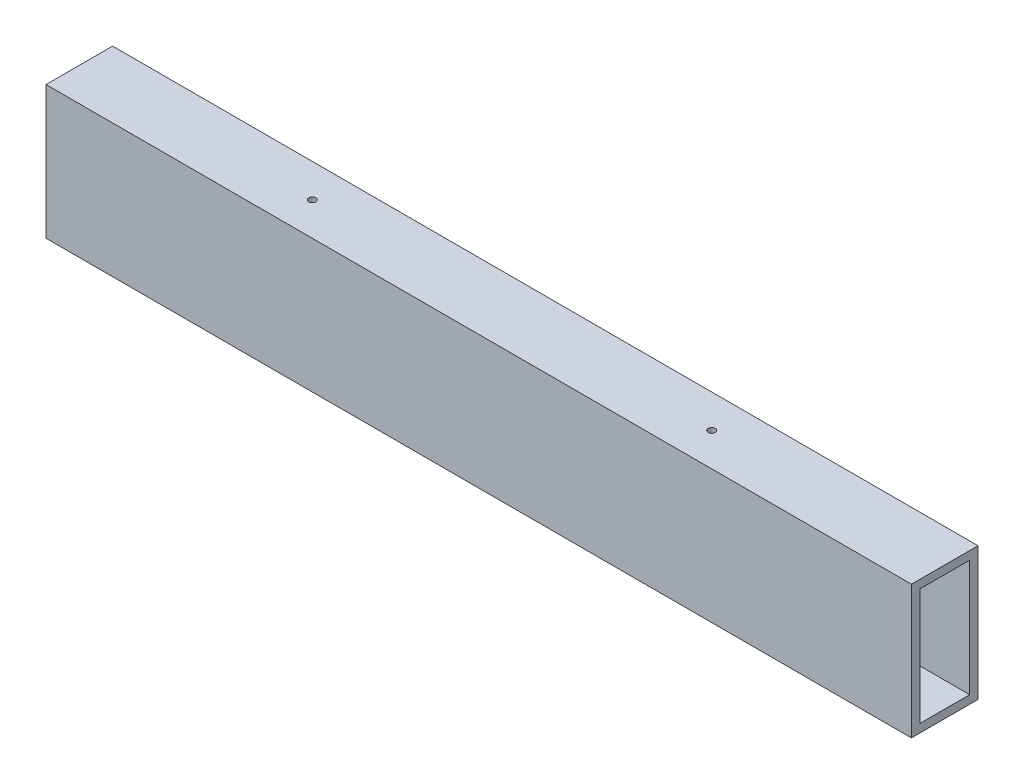
ISO-10303-21;
HEADER;
FILE_DESCRIPTION(('STEP AP214'),'2;1');
FILE_NAME('part.step','',(''),(''),'','','');
FILE_SCHEMA(('AUTOMOTIVE_DESIGN { 1 0 10303 214 1 1 1 1 }'));
ENDSEC;
DATA;
#1=APPLICATION_CONTEXT('core data for automotive mechanical design processes');
#2=APPLICATION_PROTOCOL_DEFINITION('international standard','automotive_design',2000,#1);
#3=PRODUCT_CONTEXT('',#1,'mechanical');
#4=PRODUCT('Part','Part','',(#3));
#5=PRODUCT_RELATED_PRODUCT_CATEGORY('part','',(#4));
#6=PRODUCT_DEFINITION_FORMATION('','',#4);
#7=PRODUCT_DEFINITION_CONTEXT('part definition',#1,'design');
#8=PRODUCT_DEFINITION('design','',#6,#7);
#9=PRODUCT_DEFINITION_SHAPE('','',#8);
#10=(LENGTH_UNIT() NAMED_UNIT(*) SI_UNIT(.MILLI.,.METRE.));
#11=(NAMED_UNIT(*) PLANE_ANGLE_UNIT() SI_UNIT($,.RADIAN.));
#12=(NAMED_UNIT(*) SI_UNIT($,.STERADIAN.) SOLID_ANGLE_UNIT());
#13=UNCERTAINTY_MEASURE_WITH_UNIT(LENGTH_MEASURE(1.E-05),#10,'distance_accuracy_value','');
#14=(GEOMETRIC_REPRESENTATION_CONTEXT(3) GLOBAL_UNCERTAINTY_ASSIGNED_CONTEXT((#13)) GLOBAL_UNIT_ASSIGNED_CONTEXT((#10,
#11,#12)) REPRESENTATION_CONTEXT('',''));
#15=CARTESIAN_POINT('',(0.,0.,0.));
#16=DIRECTION('',(0.,0.,1.));
#17=DIRECTION('',(1.,0.,0.));
#18=AXIS2_PLACEMENT_3D('',#15,#16,#17);
#19=CARTESIAN_POINT('',(330.2,-25.4,12.7));
#20=DIRECTION('',(0.,1.,0.));
#21=DIRECTION('',(0.,0.,1.));
#22=AXIS2_PLACEMENT_3D('',#19,#20,#21);
#23=PLANE('',#22);
#24=CARTESIAN_POINT('',(241.3,-25.4,0.));
#25=DIRECTION('',(0.,-1.,0.));
#26=DIRECTION('',(0.,0.,-1.));
#27=AXIS2_PLACEMENT_3D('',#24,#25,#26);
#28=CIRCLE('',#27,1.35254999999998);
#29=CARTESIAN_POINT('',(241.3,-25.4,-1.35254999999998));
#30=VERTEX_POINT('',#29);
#31=EDGE_CURVE('E172',#30,#30,#28,.T.);
#32=ORIENTED_EDGE('',*,*,#31,.F.);
#33=EDGE_LOOP('',(#32));
#34=FACE_BOUND('',#33,.T.);
#35=DIRECTION('',(0.,0.,-1.));
#36=VECTOR('',#35,1.);
#37=CARTESIAN_POINT('',(0.,-25.4,12.7));
#38=LINE('',#37,#36);
#39=CARTESIAN_POINT('',(0.,-25.4,12.7));
#40=VERTEX_POINT('',#39);
#41=CARTESIAN_POINT('',(0.,-25.4,-12.7));
#42=VERTEX_POINT('',#41);
#43=EDGE_CURVE('E145',#40,#42,#38,.T.);
#44=ORIENTED_EDGE('',*,*,#43,.T.);
#45=DIRECTION('',(-1.,0.,0.));
#46=VECTOR('',#45,1.);
#47=CARTESIAN_POINT('',(330.2,-25.4,-12.7));
#48=LINE('',#47,#46);
#49=CARTESIAN_POINT('',(330.2,-25.4,-12.7));
#50=VERTEX_POINT('',#49);
#51=EDGE_CURVE('E151',#50,#42,#48,.T.);
#52=ORIENTED_EDGE('',*,*,#51,.F.);
#53=DIRECTION('',(0.,0.,-1.));
#54=VECTOR('',#53,1.);
#55=CARTESIAN_POINT('',(330.2,-25.4,12.7));
#56=LINE('',#55,#54);
#57=CARTESIAN_POINT('',(330.2,-25.4,12.7));
#58=VERTEX_POINT('',#57);
#59=EDGE_CURVE('E149',#58,#50,#56,.T.);
#60=ORIENTED_EDGE('',*,*,#59,.F.);
#61=DIRECTION('',(-1.,0.,0.));
#62=VECTOR('',#61,1.);
#63=CARTESIAN_POINT('',(330.2,-25.4,12.7));
#64=LINE('',#63,#62);
#65=EDGE_CURVE('E161',#58,#40,#64,.T.);
#66=ORIENTED_EDGE('',*,*,#65,.T.);
#67=EDGE_LOOP('',(#44,#52,#60,#66));
#68=FACE_BOUND('',#67,.T.);
#69=CARTESIAN_POINT('',(88.9,-25.4,0.));
#70=DIRECTION('',(0.,-1.,0.));
#71=DIRECTION('',(0.,0.,-1.));
#72=AXIS2_PLACEMENT_3D('',#69,#70,#71);
#73=CIRCLE('',#72,1.35254999999999);
#74=CARTESIAN_POINT('',(88.9,-25.4,-1.35254999999999));
#75=VERTEX_POINT('',#74);
#76=EDGE_CURVE('E185',#75,#75,#73,.T.);
#77=ORIENTED_EDGE('',*,*,#76,.F.);
#78=EDGE_LOOP('',(#77));
#79=FACE_BOUND('',#78,.T.);
#80=ADVANCED_FACE('F35',(#34,#68,#79),#23,.F.);
#81=CARTESIAN_POINT('',(330.2,0.,0.));
#82=DIRECTION('',(-1.,0.,0.));
#83=DIRECTION('',(0.,0.,1.));
#84=AXIS2_PLACEMENT_3D('',#81,#82,#83);
#85=PLANE('',#84);
#86=DIRECTION('',(0.,1.,0.));
#87=VECTOR('',#86,1.);
#88=CARTESIAN_POINT('',(330.2,-25.4,-12.7));
#89=LINE('',#88,#87);
#90=CARTESIAN_POINT('',(330.2,25.4,-12.7));
#91=VERTEX_POINT('',#90);
#92=EDGE_CURVE('E141',#50,#91,#89,.T.);
#93=ORIENTED_EDGE('',*,*,#92,.T.);
#94=DIRECTION('',(0.,0.,1.));
#95=VECTOR('',#94,1.);
#96=CARTESIAN_POINT('',(330.2,25.4,12.7));
#97=LINE('',#96,#95);
#98=CARTESIAN_POINT('',(330.2,25.4,12.7));
#99=VERTEX_POINT('',#98);
#100=EDGE_CURVE('E144',#91,#99,#97,.T.);
#101=ORIENTED_EDGE('',*,*,#100,.T.);
#102=DIRECTION('',(0.,-1.,0.));
#103=VECTOR('',#102,1.);
#104=CARTESIAN_POINT('',(330.2,-25.4,12.7));
#105=LINE('',#104,#103);
#106=EDGE_CURVE('E147',#99,#58,#105,.T.);
#107=ORIENTED_EDGE('',*,*,#106,.T.);
#108=ORIENTED_EDGE('',*,*,#59,.T.);
#109=EDGE_LOOP('',(#93,#101,#107,#108));
#110=FACE_BOUND('',#109,.T.);
#111=DIRECTION('',(0.,-1.,0.));
#112=VECTOR('',#111,1.);
#113=CARTESIAN_POINT('',(330.2,-22.225,9.525));
#114=LINE('',#113,#112);
#115=CARTESIAN_POINT('',(330.2,22.225,9.525));
#116=VERTEX_POINT('',#115);
#117=CARTESIAN_POINT('',(330.2,-22.225,9.525));
#118=VERTEX_POINT('',#117);
#119=EDGE_CURVE('E102',#116,#118,#114,.T.);
#120=ORIENTED_EDGE('',*,*,#119,.F.);
#121=DIRECTION('',(0.,0.,1.));
#122=VECTOR('',#121,1.);
#123=CARTESIAN_POINT('',(330.2,22.225,9.525));
#124=LINE('',#123,#122);
#125=CARTESIAN_POINT('',(330.2,22.225,-9.525));
#126=VERTEX_POINT('',#125);
#127=EDGE_CURVE('E125',#126,#116,#124,.T.);
#128=ORIENTED_EDGE('',*,*,#127,.F.);
#129=DIRECTION('',(0.,1.,0.));
#130=VECTOR('',#129,1.);
#131=CARTESIAN_POINT('',(330.2,-22.225,-9.525));
#132=LINE('',#131,#130);
#133=CARTESIAN_POINT('',(330.2,-22.225,-9.525));
#134=VERTEX_POINT('',#133);
#135=EDGE_CURVE('E123',#134,#126,#132,.T.);
#136=ORIENTED_EDGE('',*,*,#135,.F.);
#137=DIRECTION('',(0.,0.,-1.));
#138=VECTOR('',#137,1.);
#139=CARTESIAN_POINT('',(330.2,-22.225,9.525));
#140=LINE('',#139,#138);
#141=EDGE_CURVE('E110',#118,#134,#140,.T.);
#142=ORIENTED_EDGE('',*,*,#141,.F.);
#143=EDGE_LOOP('',(#120,#128,#136,#142));
#144=FACE_BOUND('',#143,.T.);
#145=ADVANCED_FACE('F122',(#110,#144),#85,.F.);
#146=CARTESIAN_POINT('',(0.,0.,0.));
#147=DIRECTION('',(-1.,0.,0.));
#148=DIRECTION('',(0.,0.,1.));
#149=AXIS2_PLACEMENT_3D('',#146,#147,#148);
#150=PLANE('',#149);
#151=DIRECTION('',(0.,1.,0.));
#152=VECTOR('',#151,1.);
#153=CARTESIAN_POINT('',(0.,-25.4,-12.7));
#154=LINE('',#153,#152);
#155=CARTESIAN_POINT('',(0.,25.4,-12.7));
#156=VERTEX_POINT('',#155);
#157=EDGE_CURVE('E118',#42,#156,#154,.T.);
#158=ORIENTED_EDGE('',*,*,#157,.F.);
#159=ORIENTED_EDGE('',*,*,#43,.F.);
#160=DIRECTION('',(0.,-1.,0.));
#161=VECTOR('',#160,1.);
#162=CARTESIAN_POINT('',(0.,-25.4,12.7));
#163=LINE('',#162,#161);
#164=CARTESIAN_POINT('',(0.,25.4,12.7));
#165=VERTEX_POINT('',#164);
#166=EDGE_CURVE('E156',#165,#40,#163,.T.);
#167=ORIENTED_EDGE('',*,*,#166,.F.);
#168=DIRECTION('',(0.,0.,1.));
#169=VECTOR('',#168,1.);
#170=CARTESIAN_POINT('',(0.,25.4,12.7));
#171=LINE('',#170,#169);
#172=EDGE_CURVE('E154',#156,#165,#171,.T.);
#173=ORIENTED_EDGE('',*,*,#172,.F.);
#174=EDGE_LOOP('',(#158,#159,#167,#173));
#175=FACE_BOUND('',#174,.T.);
#176=DIRECTION('',(0.,0.,1.));
#177=VECTOR('',#176,1.);
#178=CARTESIAN_POINT('',(0.,22.225,9.525));
#179=LINE('',#178,#177);
#180=CARTESIAN_POINT('',(0.,22.225,-9.525));
#181=VERTEX_POINT('',#180);
#182=CARTESIAN_POINT('',(0.,22.225,9.525));
#183=VERTEX_POINT('',#182);
#184=EDGE_CURVE('E111',#181,#183,#179,.T.);
#185=ORIENTED_EDGE('',*,*,#184,.T.);
#186=DIRECTION('',(0.,-1.,0.));
#187=VECTOR('',#186,1.);
#188=CARTESIAN_POINT('',(0.,-22.225,9.525));
#189=LINE('',#188,#187);
#190=CARTESIAN_POINT('',(0.,-22.225,9.525));
#191=VERTEX_POINT('',#190);
#192=EDGE_CURVE('E60',#183,#191,#189,.T.);
#193=ORIENTED_EDGE('',*,*,#192,.T.);
#194=DIRECTION('',(0.,0.,-1.));
#195=VECTOR('',#194,1.);
#196=CARTESIAN_POINT('',(0.,-22.225,9.525));
#197=LINE('',#196,#195);
#198=CARTESIAN_POINT('',(0.,-22.225,-9.525));
#199=VERTEX_POINT('',#198);
#200=EDGE_CURVE('E117',#191,#199,#197,.T.);
#201=ORIENTED_EDGE('',*,*,#200,.T.);
#202=DIRECTION('',(0.,1.,0.));
#203=VECTOR('',#202,1.);
#204=CARTESIAN_POINT('',(0.,-22.225,-9.525));
#205=LINE('',#204,#203);
#206=EDGE_CURVE('E133',#199,#181,#205,.T.);
#207=ORIENTED_EDGE('',*,*,#206,.T.);
#208=EDGE_LOOP('',(#185,#193,#201,#207));
#209=FACE_BOUND('',#208,.T.);
#210=ADVANCED_FACE('F197',(#175,#209),#150,.T.);
#211=CARTESIAN_POINT('',(330.2,-25.4,-12.7));
#212=DIRECTION('',(0.,0.,1.));
#213=DIRECTION('',(1.,0.,0.));
#214=AXIS2_PLACEMENT_3D('',#211,#212,#213);
#215=PLANE('',#214);
#216=ORIENTED_EDGE('',*,*,#157,.T.);
#217=DIRECTION('',(-1.,0.,0.));
#218=VECTOR('',#217,1.);
#219=CARTESIAN_POINT('',(330.2,25.4,-12.7));
#220=LINE('',#219,#218);
#221=EDGE_CURVE('E11',#91,#156,#220,.T.);
#222=ORIENTED_EDGE('',*,*,#221,.F.);
#223=ORIENTED_EDGE('',*,*,#92,.F.);
#224=ORIENTED_EDGE('',*,*,#51,.T.);
#225=EDGE_LOOP('',(#216,#222,#223,#224));
#226=FACE_BOUND('',#225,.T.);
#227=ADVANCED_FACE('F37',(#226),#215,.F.);
#228=CARTESIAN_POINT('',(330.2,25.4,12.7));
#229=DIRECTION('',(0.,-1.,0.));
#230=DIRECTION('',(0.,0.,-1.));
#231=AXIS2_PLACEMENT_3D('',#228,#229,#230);
#232=PLANE('',#231);
#233=CARTESIAN_POINT('',(88.9,25.4,0.));
#234=DIRECTION('',(0.,-1.,0.));
#235=DIRECTION('',(0.,0.,-1.));
#236=AXIS2_PLACEMENT_3D('',#233,#234,#235);
#237=CIRCLE('',#236,1.35254999999999);
#238=CARTESIAN_POINT('',(88.9,25.4,-1.35254999999999));
#239=VERTEX_POINT('',#238);
#240=EDGE_CURVE('E182',#239,#239,#237,.T.);
#241=ORIENTED_EDGE('',*,*,#240,.T.);
#242=EDGE_LOOP('',(#241));
#243=FACE_BOUND('',#242,.T.);
#244=CARTESIAN_POINT('',(241.3,25.4,0.));
#245=DIRECTION('',(0.,-1.,0.));
#246=DIRECTION('',(0.,0.,-1.));
#247=AXIS2_PLACEMENT_3D('',#244,#245,#246);
#248=CIRCLE('',#247,1.35254999999998);
#249=CARTESIAN_POINT('',(241.3,25.4,-1.35254999999998));
#250=VERTEX_POINT('',#249);
#251=EDGE_CURVE('E167',#250,#250,#248,.T.);
#252=ORIENTED_EDGE('',*,*,#251,.T.);
#253=EDGE_LOOP('',(#252));
#254=FACE_BOUND('',#253,.T.);
#255=ORIENTED_EDGE('',*,*,#172,.T.);
#256=DIRECTION('',(-1.,0.,0.));
#257=VECTOR('',#256,1.);
#258=CARTESIAN_POINT('',(330.2,25.4,12.7));
#259=LINE('',#258,#257);
#260=EDGE_CURVE('E44',#99,#165,#259,.T.);
#261=ORIENTED_EDGE('',*,*,#260,.F.);
#262=ORIENTED_EDGE('',*,*,#100,.F.);
#263=ORIENTED_EDGE('',*,*,#221,.T.);
#264=EDGE_LOOP('',(#255,#261,#262,#263));
#265=FACE_BOUND('',#264,.T.);
#266=ADVANCED_FACE('F206',(#243,#254,#265),#232,.F.);
#267=CARTESIAN_POINT('',(330.2,-25.4,12.7));
#268=DIRECTION('',(0.,0.,-1.));
#269=DIRECTION('',(-1.,0.,0.));
#270=AXIS2_PLACEMENT_3D('',#267,#268,#269);
#271=PLANE('',#270);
#272=ORIENTED_EDGE('',*,*,#166,.T.);
#273=ORIENTED_EDGE('',*,*,#65,.F.);
#274=ORIENTED_EDGE('',*,*,#106,.F.);
#275=ORIENTED_EDGE('',*,*,#260,.T.);
#276=EDGE_LOOP('',(#272,#273,#274,#275));
#277=FACE_BOUND('',#276,.T.);
#278=ADVANCED_FACE('F204',(#277),#271,.F.);
#279=CARTESIAN_POINT('',(330.2,-22.225,9.525));
#280=DIRECTION('',(0.,0.,-1.));
#281=DIRECTION('',(-1.,0.,0.));
#282=AXIS2_PLACEMENT_3D('',#279,#280,#281);
#283=PLANE('',#282);
#284=ORIENTED_EDGE('',*,*,#192,.F.);
#285=DIRECTION('',(-1.,0.,0.));
#286=VECTOR('',#285,1.);
#287=CARTESIAN_POINT('',(330.2,22.225,9.525));
#288=LINE('',#287,#286);
#289=EDGE_CURVE('E106',#116,#183,#288,.T.);
#290=ORIENTED_EDGE('',*,*,#289,.F.);
#291=ORIENTED_EDGE('',*,*,#119,.T.);
#292=DIRECTION('',(-1.,0.,0.));
#293=VECTOR('',#292,1.);
#294=CARTESIAN_POINT('',(330.2,-22.225,9.525));
#295=LINE('',#294,#293);
#296=EDGE_CURVE('E105',#118,#191,#295,.T.);
#297=ORIENTED_EDGE('',*,*,#296,.T.);
#298=EDGE_LOOP('',(#284,#290,#291,#297));
#299=FACE_BOUND('',#298,.T.);
#300=ADVANCED_FACE('F104',(#299),#283,.T.);
#301=CARTESIAN_POINT('',(330.2,-22.225,9.525));
#302=DIRECTION('',(0.,1.,0.));
#303=DIRECTION('',(0.,0.,1.));
#304=AXIS2_PLACEMENT_3D('',#301,#302,#303);
#305=PLANE('',#304);
#306=CARTESIAN_POINT('',(88.9,-22.225,0.));
#307=DIRECTION('',(0.,1.,0.));
#308=DIRECTION('',(0.,0.,1.));
#309=AXIS2_PLACEMENT_3D('',#306,#307,#308);
#310=CIRCLE('',#309,1.35254999999999);
#311=CARTESIAN_POINT('',(88.9,-22.225,1.35254999999999));
#312=VERTEX_POINT('',#311);
#313=EDGE_CURVE('E177',#312,#312,#310,.T.);
#314=ORIENTED_EDGE('',*,*,#313,.F.);
#315=EDGE_LOOP('',(#314));
#316=FACE_BOUND('',#315,.T.);
#317=CARTESIAN_POINT('',(241.3,-22.225,0.));
#318=DIRECTION('',(0.,1.,0.));
#319=DIRECTION('',(0.,0.,1.));
#320=AXIS2_PLACEMENT_3D('',#317,#318,#319);
#321=CIRCLE('',#320,1.35254999999998);
#322=CARTESIAN_POINT('',(241.3,-22.225,1.35254999999998));
#323=VERTEX_POINT('',#322);
#324=EDGE_CURVE('E165',#323,#323,#321,.T.);
#325=ORIENTED_EDGE('',*,*,#324,.F.);
#326=EDGE_LOOP('',(#325));
#327=FACE_BOUND('',#326,.T.);
#328=ORIENTED_EDGE('',*,*,#200,.F.);
#329=ORIENTED_EDGE('',*,*,#296,.F.);
#330=ORIENTED_EDGE('',*,*,#141,.T.);
#331=DIRECTION('',(-1.,0.,0.));
#332=VECTOR('',#331,1.);
#333=CARTESIAN_POINT('',(330.2,-22.225,-9.525));
#334=LINE('',#333,#332);
#335=EDGE_CURVE('E119',#134,#199,#334,.T.);
#336=ORIENTED_EDGE('',*,*,#335,.T.);
#337=EDGE_LOOP('',(#328,#329,#330,#336));
#338=FACE_BOUND('',#337,.T.);
#339=ADVANCED_FACE('F114',(#316,#327,#338),#305,.T.);
#340=CARTESIAN_POINT('',(330.2,-22.225,-9.525));
#341=DIRECTION('',(0.,0.,1.));
#342=DIRECTION('',(1.,0.,0.));
#343=AXIS2_PLACEMENT_3D('',#340,#341,#342);
#344=PLANE('',#343);
#345=ORIENTED_EDGE('',*,*,#206,.F.);
#346=ORIENTED_EDGE('',*,*,#335,.F.);
#347=ORIENTED_EDGE('',*,*,#135,.T.);
#348=DIRECTION('',(-1.,0.,0.));
#349=VECTOR('',#348,1.);
#350=CARTESIAN_POINT('',(330.2,22.225,-9.525));
#351=LINE('',#350,#349);
#352=EDGE_CURVE('E52',#126,#181,#351,.T.);
#353=ORIENTED_EDGE('',*,*,#352,.T.);
#354=EDGE_LOOP('',(#345,#346,#347,#353));
#355=FACE_BOUND('',#354,.T.);
#356=ADVANCED_FACE('F233',(#355),#344,.T.);
#357=CARTESIAN_POINT('',(330.2,22.225,9.525));
#358=DIRECTION('',(0.,-1.,0.));
#359=DIRECTION('',(0.,0.,-1.));
#360=AXIS2_PLACEMENT_3D('',#357,#358,#359);
#361=PLANE('',#360);
#362=CARTESIAN_POINT('',(88.9,22.225,0.));
#363=DIRECTION('',(0.,-1.,0.));
#364=DIRECTION('',(0.,0.,-1.));
#365=AXIS2_PLACEMENT_3D('',#362,#363,#364);
#366=CIRCLE('',#365,1.35254999999999);
#367=CARTESIAN_POINT('',(88.9,22.225,-1.35254999999999));
#368=VERTEX_POINT('',#367);
#369=EDGE_CURVE('E39',#368,#368,#366,.T.);
#370=ORIENTED_EDGE('',*,*,#369,.F.);
#371=EDGE_LOOP('',(#370));
#372=FACE_BOUND('',#371,.T.);
#373=CARTESIAN_POINT('',(241.3,22.225,0.));
#374=DIRECTION('',(0.,-1.,0.));
#375=DIRECTION('',(0.,0.,-1.));
#376=AXIS2_PLACEMENT_3D('',#373,#374,#375);
#377=CIRCLE('',#376,1.35254999999998);
#378=CARTESIAN_POINT('',(241.3,22.225,-1.35254999999998));
#379=VERTEX_POINT('',#378);
#380=EDGE_CURVE('E131',#379,#379,#377,.T.);
#381=ORIENTED_EDGE('',*,*,#380,.F.);
#382=EDGE_LOOP('',(#381));
#383=FACE_BOUND('',#382,.T.);
#384=ORIENTED_EDGE('',*,*,#184,.F.);
#385=ORIENTED_EDGE('',*,*,#352,.F.);
#386=ORIENTED_EDGE('',*,*,#127,.T.);
#387=ORIENTED_EDGE('',*,*,#289,.T.);
#388=EDGE_LOOP('',(#384,#385,#386,#387));
#389=FACE_BOUND('',#388,.T.);
#390=ADVANCED_FACE('F230',(#372,#383,#389),#361,.T.);
#391=CARTESIAN_POINT('',(241.3,-25.4,0.));
#392=DIRECTION('',(0.,-1.,0.));
#393=DIRECTION('',(0.,0.,-1.));
#394=AXIS2_PLACEMENT_3D('',#391,#392,#393);
#395=CYLINDRICAL_SURFACE('',#394,1.35254999999998);
#396=ORIENTED_EDGE('',*,*,#324,.T.);
#397=EDGE_LOOP('',(#396));
#398=FACE_BOUND('',#397,.T.);
#399=ORIENTED_EDGE('',*,*,#31,.T.);
#400=EDGE_LOOP('',(#399));
#401=FACE_BOUND('',#400,.T.);
#402=ADVANCED_FACE('F232',(#398,#401),#395,.F.);
#403=ORIENTED_EDGE('',*,*,#380,.T.);
#404=EDGE_LOOP('',(#403));
#405=FACE_BOUND('',#404,.T.);
#406=ORIENTED_EDGE('',*,*,#251,.F.);
#407=EDGE_LOOP('',(#406));
#408=FACE_BOUND('',#407,.T.);
#409=ADVANCED_FACE('F240',(#405,#408),#395,.F.);
#410=CARTESIAN_POINT('',(88.9,-25.4,0.));
#411=DIRECTION('',(0.,-1.,0.));
#412=DIRECTION('',(0.,0.,-1.));
#413=AXIS2_PLACEMENT_3D('',#410,#411,#412);
#414=CYLINDRICAL_SURFACE('',#413,1.35254999999999);
#415=ORIENTED_EDGE('',*,*,#369,.T.);
#416=EDGE_LOOP('',(#415));
#417=FACE_BOUND('',#416,.T.);
#418=ORIENTED_EDGE('',*,*,#240,.F.);
#419=EDGE_LOOP('',(#418));
#420=FACE_BOUND('',#419,.T.);
#421=ADVANCED_FACE('F316',(#417,#420),#414,.F.);
#422=ORIENTED_EDGE('',*,*,#313,.T.);
#423=EDGE_LOOP('',(#422));
#424=FACE_BOUND('',#423,.T.);
#425=ORIENTED_EDGE('',*,*,#76,.T.);
#426=EDGE_LOOP('',(#425));
#427=FACE_BOUND('',#426,.T.);
#428=ADVANCED_FACE('F189',(#424,#427),#414,.F.);
#429=CLOSED_SHELL('',(#80,#145,#210,#227,#266,#278,#300,#339,#356,#390,#402,#409,#421,#428));
#430=MANIFOLD_SOLID_BREP('B2',#429);
#431=ADVANCED_BREP_SHAPE_REPRESENTATION('',(#18,#430),#14);
#432=SHAPE_DEFINITION_REPRESENTATION(#9,#431);
ENDSEC;
END-ISO-10303-21;
